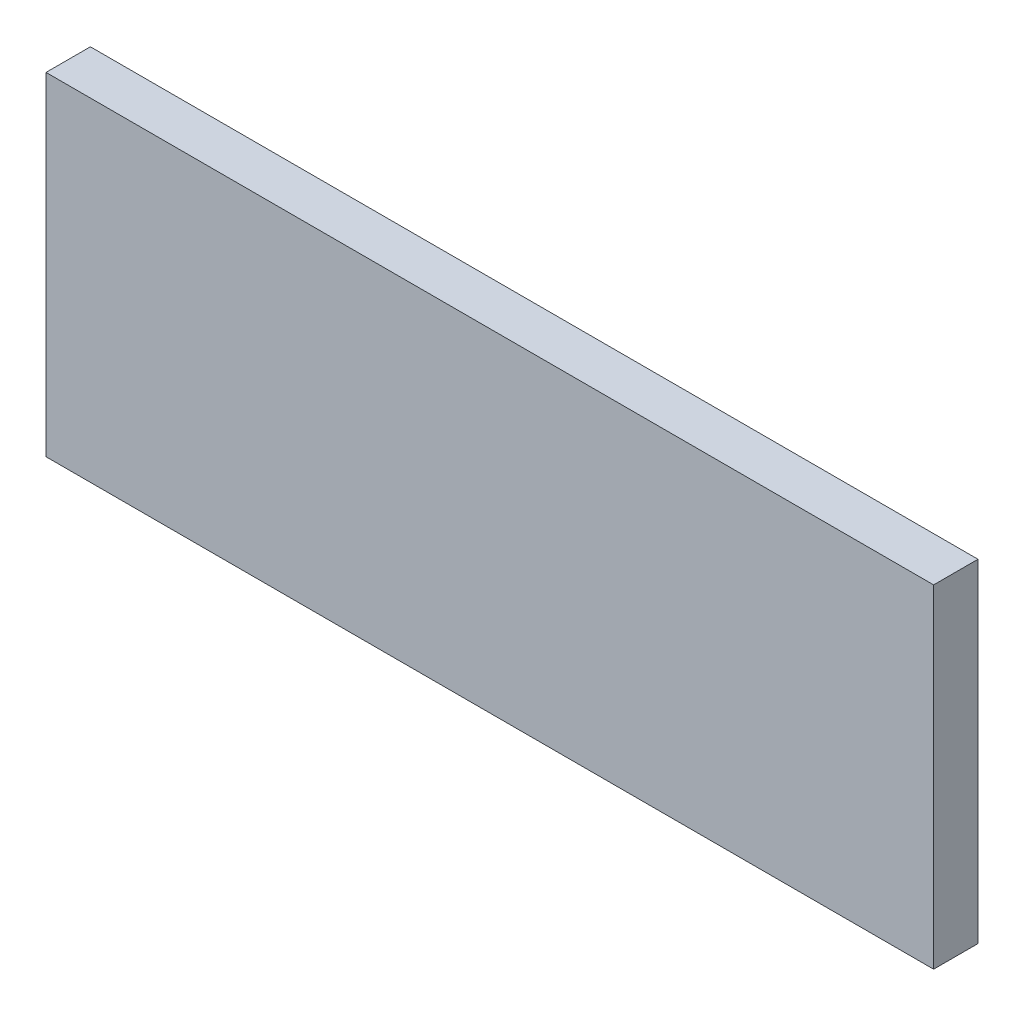
ISO-10303-21;
HEADER;
FILE_DESCRIPTION(('STEP AP214'),'2;1');
FILE_NAME('part.step','',(''),(''),'','','');
FILE_SCHEMA(('AUTOMOTIVE_DESIGN { 1 0 10303 214 1 1 1 1 }'));
ENDSEC;
DATA;
#1=APPLICATION_CONTEXT('core data for automotive mechanical design processes');
#2=APPLICATION_PROTOCOL_DEFINITION('international standard','automotive_design',2000,#1);
#3=PRODUCT_CONTEXT('',#1,'mechanical');
#4=PRODUCT('Part','Part','',(#3));
#5=PRODUCT_RELATED_PRODUCT_CATEGORY('part','',(#4));
#6=PRODUCT_DEFINITION_FORMATION('','',#4);
#7=PRODUCT_DEFINITION_CONTEXT('part definition',#1,'design');
#8=PRODUCT_DEFINITION('design','',#6,#7);
#9=PRODUCT_DEFINITION_SHAPE('','',#8);
#10=(LENGTH_UNIT() NAMED_UNIT(*) SI_UNIT(.MILLI.,.METRE.));
#11=(NAMED_UNIT(*) PLANE_ANGLE_UNIT() SI_UNIT($,.RADIAN.));
#12=(NAMED_UNIT(*) SI_UNIT($,.STERADIAN.) SOLID_ANGLE_UNIT());
#13=UNCERTAINTY_MEASURE_WITH_UNIT(LENGTH_MEASURE(1.E-05),#10,'distance_accuracy_value','');
#14=(GEOMETRIC_REPRESENTATION_CONTEXT(3) GLOBAL_UNCERTAINTY_ASSIGNED_CONTEXT((#13)) GLOBAL_UNIT_ASSIGNED_CONTEXT((#10,
#11,#12)) REPRESENTATION_CONTEXT('',''));
#15=CARTESIAN_POINT('',(0.,0.,0.));
#16=DIRECTION('',(0.,0.,1.));
#17=DIRECTION('',(1.,0.,0.));
#18=AXIS2_PLACEMENT_3D('',#15,#16,#17);
#19=CARTESIAN_POINT('',(-40.,15.,4.));
#20=DIRECTION('',(1.,0.,0.));
#21=DIRECTION('',(0.,0.,-1.));
#22=AXIS2_PLACEMENT_3D('',#19,#20,#21);
#23=PLANE('',#22);
#24=DIRECTION('',(0.,-1.,0.));
#25=VECTOR('',#24,1.);
#26=CARTESIAN_POINT('',(-40.,15.,0.));
#27=LINE('',#26,#25);
#28=CARTESIAN_POINT('',(-40.,15.,0.));
#29=VERTEX_POINT('',#28);
#30=CARTESIAN_POINT('',(-40.,-15.,0.));
#31=VERTEX_POINT('',#30);
#32=EDGE_CURVE('E97',#29,#31,#27,.T.);
#33=ORIENTED_EDGE('',*,*,#32,.T.);
#34=DIRECTION('',(0.,0.,-1.));
#35=VECTOR('',#34,1.);
#36=CARTESIAN_POINT('',(-40.,-15.,4.));
#37=LINE('',#36,#35);
#38=CARTESIAN_POINT('',(-40.,-15.,4.));
#39=VERTEX_POINT('',#38);
#40=EDGE_CURVE('E11',#39,#31,#37,.T.);
#41=ORIENTED_EDGE('',*,*,#40,.F.);
#42=DIRECTION('',(0.,-1.,0.));
#43=VECTOR('',#42,1.);
#44=CARTESIAN_POINT('',(-40.,15.,4.));
#45=LINE('',#44,#43);
#46=CARTESIAN_POINT('',(-40.,15.,4.));
#47=VERTEX_POINT('',#46);
#48=EDGE_CURVE('E83',#47,#39,#45,.T.);
#49=ORIENTED_EDGE('',*,*,#48,.F.);
#50=DIRECTION('',(0.,0.,-1.));
#51=VECTOR('',#50,1.);
#52=CARTESIAN_POINT('',(-40.,15.,4.));
#53=LINE('',#52,#51);
#54=EDGE_CURVE('E50',#47,#29,#53,.T.);
#55=ORIENTED_EDGE('',*,*,#54,.T.);
#56=EDGE_LOOP('',(#33,#41,#49,#55));
#57=FACE_BOUND('',#56,.T.);
#58=ADVANCED_FACE('F34',(#57),#23,.F.);
#59=CARTESIAN_POINT('',(-40.,-15.,4.));
#60=DIRECTION('',(0.,1.,0.));
#61=DIRECTION('',(0.,0.,1.));
#62=AXIS2_PLACEMENT_3D('',#59,#60,#61);
#63=PLANE('',#62);
#64=DIRECTION('',(1.,0.,0.));
#65=VECTOR('',#64,1.);
#66=CARTESIAN_POINT('',(-40.,-15.,0.));
#67=LINE('',#66,#65);
#68=CARTESIAN_POINT('',(40.,-15.,0.));
#69=VERTEX_POINT('',#68);
#70=EDGE_CURVE('E88',#31,#69,#67,.T.);
#71=ORIENTED_EDGE('',*,*,#70,.T.);
#72=DIRECTION('',(0.,0.,-1.));
#73=VECTOR('',#72,1.);
#74=CARTESIAN_POINT('',(40.,-15.,4.));
#75=LINE('',#74,#73);
#76=CARTESIAN_POINT('',(40.,-15.,4.));
#77=VERTEX_POINT('',#76);
#78=EDGE_CURVE('E42',#77,#69,#75,.T.);
#79=ORIENTED_EDGE('',*,*,#78,.F.);
#80=DIRECTION('',(1.,0.,0.));
#81=VECTOR('',#80,1.);
#82=CARTESIAN_POINT('',(-40.,-15.,4.));
#83=LINE('',#82,#81);
#84=EDGE_CURVE('E75',#39,#77,#83,.T.);
#85=ORIENTED_EDGE('',*,*,#84,.F.);
#86=ORIENTED_EDGE('',*,*,#40,.T.);
#87=EDGE_LOOP('',(#71,#79,#85,#86));
#88=FACE_BOUND('',#87,.T.);
#89=ADVANCED_FACE('F87',(#88),#63,.F.);
#90=CARTESIAN_POINT('',(40.,15.,4.));
#91=DIRECTION('',(1.,0.,0.));
#92=DIRECTION('',(0.,1.,0.));
#93=AXIS2_PLACEMENT_3D('',#90,#91,#92);
#94=PLANE('',#93);
#95=DIRECTION('',(0.,-1.,0.));
#96=VECTOR('',#95,1.);
#97=CARTESIAN_POINT('',(40.,15.,0.));
#98=LINE('',#97,#96);
#99=CARTESIAN_POINT('',(40.,15.,0.));
#100=VERTEX_POINT('',#99);
#101=EDGE_CURVE('E100',#100,#69,#98,.T.);
#102=ORIENTED_EDGE('',*,*,#101,.F.);
#103=DIRECTION('',(0.,0.,-1.));
#104=VECTOR('',#103,1.);
#105=CARTESIAN_POINT('',(40.,15.,4.));
#106=LINE('',#105,#104);
#107=CARTESIAN_POINT('',(40.,15.,4.));
#108=VERTEX_POINT('',#107);
#109=EDGE_CURVE('E64',#108,#100,#106,.T.);
#110=ORIENTED_EDGE('',*,*,#109,.F.);
#111=DIRECTION('',(0.,-1.,0.));
#112=VECTOR('',#111,1.);
#113=CARTESIAN_POINT('',(40.,15.,4.));
#114=LINE('',#113,#112);
#115=EDGE_CURVE('E82',#108,#77,#114,.T.);
#116=ORIENTED_EDGE('',*,*,#115,.T.);
#117=ORIENTED_EDGE('',*,*,#78,.T.);
#118=EDGE_LOOP('',(#102,#110,#116,#117));
#119=FACE_BOUND('',#118,.T.);
#120=ADVANCED_FACE('F91',(#119),#94,.T.);
#121=CARTESIAN_POINT('',(-40.,15.,4.));
#122=DIRECTION('',(0.,1.,0.));
#123=DIRECTION('',(0.,0.,1.));
#124=AXIS2_PLACEMENT_3D('',#121,#122,#123);
#125=PLANE('',#124);
#126=DIRECTION('',(1.,0.,0.));
#127=VECTOR('',#126,1.);
#128=CARTESIAN_POINT('',(-40.,15.,0.));
#129=LINE('',#128,#127);
#130=EDGE_CURVE('E102',#29,#100,#129,.T.);
#131=ORIENTED_EDGE('',*,*,#130,.F.);
#132=ORIENTED_EDGE('',*,*,#54,.F.);
#133=DIRECTION('',(1.,0.,0.));
#134=VECTOR('',#133,1.);
#135=CARTESIAN_POINT('',(-40.,15.,4.));
#136=LINE('',#135,#134);
#137=EDGE_CURVE('E92',#47,#108,#136,.T.);
#138=ORIENTED_EDGE('',*,*,#137,.T.);
#139=ORIENTED_EDGE('',*,*,#109,.T.);
#140=EDGE_LOOP('',(#131,#132,#138,#139));
#141=FACE_BOUND('',#140,.T.);
#142=ADVANCED_FACE('F108',(#141),#125,.T.);
#143=CARTESIAN_POINT('',(0.,0.,4.));
#144=DIRECTION('',(0.,0.,1.));
#145=DIRECTION('',(1.,0.,0.));
#146=AXIS2_PLACEMENT_3D('',#143,#144,#145);
#147=PLANE('',#146);
#148=ORIENTED_EDGE('',*,*,#48,.T.);
#149=ORIENTED_EDGE('',*,*,#84,.T.);
#150=ORIENTED_EDGE('',*,*,#115,.F.);
#151=ORIENTED_EDGE('',*,*,#137,.F.);
#152=EDGE_LOOP('',(#148,#149,#150,#151));
#153=FACE_BOUND('',#152,.T.);
#154=ADVANCED_FACE('F79',(#153),#147,.T.);
#155=CARTESIAN_POINT('',(0.,0.,0.));
#156=DIRECTION('',(0.,0.,1.));
#157=DIRECTION('',(1.,0.,0.));
#158=AXIS2_PLACEMENT_3D('',#155,#156,#157);
#159=PLANE('',#158);
#160=ORIENTED_EDGE('',*,*,#32,.F.);
#161=ORIENTED_EDGE('',*,*,#130,.T.);
#162=ORIENTED_EDGE('',*,*,#101,.T.);
#163=ORIENTED_EDGE('',*,*,#70,.F.);
#164=EDGE_LOOP('',(#160,#161,#162,#163));
#165=FACE_BOUND('',#164,.T.);
#166=ADVANCED_FACE('F107',(#165),#159,.F.);
#167=CLOSED_SHELL('',(#58,#89,#120,#142,#154,#166));
#168=MANIFOLD_SOLID_BREP('B2',#167);
#169=ADVANCED_BREP_SHAPE_REPRESENTATION('',(#18,#168),#14);
#170=SHAPE_DEFINITION_REPRESENTATION(#9,#169);
ENDSEC;
END-ISO-10303-21;
